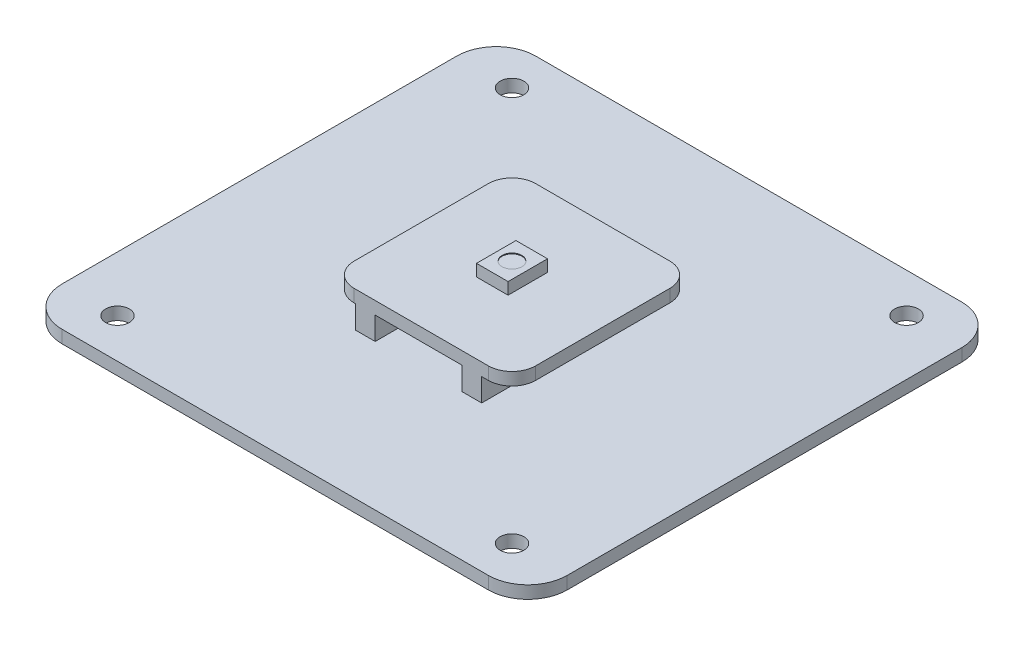
ISO-10303-21;
HEADER;
FILE_DESCRIPTION(('STEP AP214'),'2;1');
FILE_NAME('part.step','',(''),(''),'','','');
FILE_SCHEMA(('AUTOMOTIVE_DESIGN { 1 0 10303 214 1 1 1 1 }'));
ENDSEC;
DATA;
#1=APPLICATION_CONTEXT('core data for automotive mechanical design processes');
#2=APPLICATION_PROTOCOL_DEFINITION('international standard','automotive_design',2000,#1);
#3=PRODUCT_CONTEXT('',#1,'mechanical');
#4=PRODUCT('Part','Part','',(#3));
#5=PRODUCT_RELATED_PRODUCT_CATEGORY('part','',(#4));
#6=PRODUCT_DEFINITION_FORMATION('','',#4);
#7=PRODUCT_DEFINITION_CONTEXT('part definition',#1,'design');
#8=PRODUCT_DEFINITION('design','',#6,#7);
#9=PRODUCT_DEFINITION_SHAPE('','',#8);
#10=(LENGTH_UNIT() NAMED_UNIT(*) SI_UNIT(.MILLI.,.METRE.));
#11=(NAMED_UNIT(*) PLANE_ANGLE_UNIT() SI_UNIT($,.RADIAN.));
#12=(NAMED_UNIT(*) SI_UNIT($,.STERADIAN.) SOLID_ANGLE_UNIT());
#13=UNCERTAINTY_MEASURE_WITH_UNIT(LENGTH_MEASURE(1.E-05),#10,'distance_accuracy_value','');
#14=(GEOMETRIC_REPRESENTATION_CONTEXT(3) GLOBAL_UNCERTAINTY_ASSIGNED_CONTEXT((#13)) GLOBAL_UNIT_ASSIGNED_CONTEXT((#10,
#11,#12)) REPRESENTATION_CONTEXT('',''));
#15=CARTESIAN_POINT('',(0.,0.,0.));
#16=DIRECTION('',(0.,0.,1.));
#17=DIRECTION('',(1.,0.,0.));
#18=AXIS2_PLACEMENT_3D('',#15,#16,#17);
#19=CARTESIAN_POINT('',(-11.5,4.5,-28.));
#20=DIRECTION('',(0.,1.,0.));
#21=DIRECTION('',(0.,0.,1.));
#22=AXIS2_PLACEMENT_3D('',#19,#20,#21);
#23=PLANE('',#22);
#24=DIRECTION('',(-1.,0.,0.));
#25=VECTOR('',#24,1.);
#26=CARTESIAN_POINT('',(-11.5,4.5,-11.5));
#27=LINE('',#26,#25);
#28=CARTESIAN_POINT('',(5.15955688952513,4.5,-11.5));
#29=VERTEX_POINT('',#28);
#30=CARTESIAN_POINT('',(-5.84044311047487,4.5,-11.5));
#31=VERTEX_POINT('',#30);
#32=EDGE_CURVE('E312',#29,#31,#27,.T.);
#33=ORIENTED_EDGE('',*,*,#32,.F.);
#34=DIRECTION('',(0.,0.,1.));
#35=VECTOR('',#34,1.);
#36=CARTESIAN_POINT('',(5.15955688952513,4.5,-15.3288379438153));
#37=LINE('',#36,#35);
#38=CARTESIAN_POINT('',(5.15955688952513,4.5,11.5));
#39=VERTEX_POINT('',#38);
#40=EDGE_CURVE('E240',#29,#39,#37,.T.);
#41=ORIENTED_EDGE('',*,*,#40,.T.);
#42=DIRECTION('',(-1.,0.,0.));
#43=VECTOR('',#42,1.);
#44=CARTESIAN_POINT('',(-11.5,4.5,11.5));
#45=LINE('',#44,#43);
#46=CARTESIAN_POINT('',(-5.84044311047487,4.5,11.5));
#47=VERTEX_POINT('',#46);
#48=EDGE_CURVE('E228',#39,#47,#45,.T.);
#49=ORIENTED_EDGE('',*,*,#48,.T.);
#50=DIRECTION('',(0.,0.,1.));
#51=VECTOR('',#50,1.);
#52=CARTESIAN_POINT('',(-5.84044311047487,4.5,-15.3288379438153));
#53=LINE('',#52,#51);
#54=EDGE_CURVE('E333',#31,#47,#53,.T.);
#55=ORIENTED_EDGE('',*,*,#54,.F.);
#56=EDGE_LOOP('',(#33,#41,#49,#55));
#57=FACE_BOUND('',#56,.T.);
#58=ADVANCED_FACE('F32',(#57),#23,.F.);
#59=CARTESIAN_POINT('',(-27.,0.,25.));
#60=DIRECTION('',(0.,-1.,0.));
#61=DIRECTION('',(0.,0.,-1.));
#62=AXIS2_PLACEMENT_3D('',#59,#60,#61);
#63=PLANE('',#62);
#64=CARTESIAN_POINT('',(-24.9999999999995,0.,25.0000000000004));
#65=DIRECTION('',(0.,1.,0.));
#66=DIRECTION('',(0.,0.,1.));
#67=AXIS2_PLACEMENT_3D('',#64,#65,#66);
#68=CIRCLE('',#67,1.5);
#69=CARTESIAN_POINT('',(-24.9999999999995,0.,26.5000000000004));
#70=VERTEX_POINT('',#69);
#71=EDGE_CURVE('E346',#70,#70,#68,.T.);
#72=ORIENTED_EDGE('',*,*,#71,.T.);
#73=EDGE_LOOP('',(#72));
#74=FACE_BOUND('',#73,.T.);
#75=CARTESIAN_POINT('',(25.,0.,-25.));
#76=DIRECTION('',(0.,1.,0.));
#77=DIRECTION('',(0.,0.,1.));
#78=AXIS2_PLACEMENT_3D('',#75,#76,#77);
#79=CIRCLE('',#78,1.5);
#80=CARTESIAN_POINT('',(25.,0.,-23.5));
#81=VERTEX_POINT('',#80);
#82=EDGE_CURVE('E358',#81,#81,#79,.T.);
#83=ORIENTED_EDGE('',*,*,#82,.T.);
#84=EDGE_LOOP('',(#83));
#85=FACE_BOUND('',#84,.T.);
#86=CARTESIAN_POINT('',(-27.,0.,25.));
#87=DIRECTION('',(0.,1.,0.));
#88=DIRECTION('',(0.,0.,-1.));
#89=AXIS2_PLACEMENT_3D('',#86,#87,#88);
#90=CIRCLE('',#89,5.);
#91=CARTESIAN_POINT('',(-32.,0.,25.));
#92=VERTEX_POINT('',#91);
#93=CARTESIAN_POINT('',(-27.,0.,30.));
#94=VERTEX_POINT('',#93);
#95=EDGE_CURVE('E364',#92,#94,#90,.T.);
#96=ORIENTED_EDGE('',*,*,#95,.F.);
#97=DIRECTION('',(0.,0.,1.));
#98=VECTOR('',#97,1.);
#99=CARTESIAN_POINT('',(-32.,0.,25.));
#100=LINE('',#99,#98);
#101=CARTESIAN_POINT('',(-32.,0.,-25.));
#102=VERTEX_POINT('',#101);
#103=EDGE_CURVE('E371',#102,#92,#100,.T.);
#104=ORIENTED_EDGE('',*,*,#103,.F.);
#105=CARTESIAN_POINT('',(-27.,0.,-25.));
#106=DIRECTION('',(0.,1.,0.));
#107=DIRECTION('',(0.,0.,-1.));
#108=AXIS2_PLACEMENT_3D('',#105,#106,#107);
#109=CIRCLE('',#108,5.);
#110=CARTESIAN_POINT('',(-27.,0.,-30.));
#111=VERTEX_POINT('',#110);
#112=EDGE_CURVE('E398',#111,#102,#109,.T.);
#113=ORIENTED_EDGE('',*,*,#112,.F.);
#114=DIRECTION('',(-1.,0.,0.));
#115=VECTOR('',#114,1.);
#116=CARTESIAN_POINT('',(-27.,0.,-30.));
#117=LINE('',#116,#115);
#118=CARTESIAN_POINT('',(27.,0.,-30.));
#119=VERTEX_POINT('',#118);
#120=EDGE_CURVE('E396',#119,#111,#117,.T.);
#121=ORIENTED_EDGE('',*,*,#120,.F.);
#122=CARTESIAN_POINT('',(27.,0.,-25.));
#123=DIRECTION('',(0.,1.,0.));
#124=DIRECTION('',(0.,0.,-1.));
#125=AXIS2_PLACEMENT_3D('',#122,#123,#124);
#126=CIRCLE('',#125,5.);
#127=CARTESIAN_POINT('',(32.,0.,-25.));
#128=VERTEX_POINT('',#127);
#129=EDGE_CURVE('E394',#128,#119,#126,.T.);
#130=ORIENTED_EDGE('',*,*,#129,.F.);
#131=DIRECTION('',(0.,0.,-1.));
#132=VECTOR('',#131,1.);
#133=CARTESIAN_POINT('',(32.,0.,25.));
#134=LINE('',#133,#132);
#135=CARTESIAN_POINT('',(32.,0.,25.));
#136=VERTEX_POINT('',#135);
#137=EDGE_CURVE('E392',#136,#128,#134,.T.);
#138=ORIENTED_EDGE('',*,*,#137,.F.);
#139=CARTESIAN_POINT('',(27.,0.,25.));
#140=DIRECTION('',(0.,1.,0.));
#141=DIRECTION('',(0.,0.,1.));
#142=AXIS2_PLACEMENT_3D('',#139,#140,#141);
#143=CIRCLE('',#142,5.);
#144=CARTESIAN_POINT('',(27.,0.,30.));
#145=VERTEX_POINT('',#144);
#146=EDGE_CURVE('E390',#145,#136,#143,.T.);
#147=ORIENTED_EDGE('',*,*,#146,.F.);
#148=DIRECTION('',(1.,0.,0.));
#149=VECTOR('',#148,1.);
#150=CARTESIAN_POINT('',(-27.,0.,30.));
#151=LINE('',#150,#149);
#152=EDGE_CURVE('E388',#94,#145,#151,.T.);
#153=ORIENTED_EDGE('',*,*,#152,.F.);
#154=EDGE_LOOP('',(#96,#104,#113,#121,#130,#138,#147,#153));
#155=FACE_BOUND('',#154,.T.);
#156=CARTESIAN_POINT('',(-25.,0.,-24.9999999999996));
#157=DIRECTION('',(0.,1.,0.));
#158=DIRECTION('',(0.,0.,1.));
#159=AXIS2_PLACEMENT_3D('',#156,#157,#158);
#160=CIRCLE('',#159,1.5);
#161=CARTESIAN_POINT('',(-25.,0.,-23.4999999999996));
#162=VERTEX_POINT('',#161);
#163=EDGE_CURVE('E352',#162,#162,#160,.T.);
#164=ORIENTED_EDGE('',*,*,#163,.T.);
#165=EDGE_LOOP('',(#164));
#166=FACE_BOUND('',#165,.T.);
#167=CARTESIAN_POINT('',(25.0000000000005,0.,25.));
#168=DIRECTION('',(0.,1.,0.));
#169=DIRECTION('',(0.,0.,1.));
#170=AXIS2_PLACEMENT_3D('',#167,#168,#169);
#171=CIRCLE('',#170,1.5);
#172=CARTESIAN_POINT('',(25.0000000000005,0.,26.5));
#173=VERTEX_POINT('',#172);
#174=EDGE_CURVE('E342',#173,#173,#171,.T.);
#175=ORIENTED_EDGE('',*,*,#174,.T.);
#176=EDGE_LOOP('',(#175));
#177=FACE_BOUND('',#176,.T.);
#178=ADVANCED_FACE('F510',(#74,#85,#155,#166,#177),#63,.T.);
#179=CARTESIAN_POINT('',(-32.,1.6,25.));
#180=DIRECTION('',(1.,0.,0.));
#181=DIRECTION('',(0.,0.,-1.));
#182=AXIS2_PLACEMENT_3D('',#179,#180,#181);
#183=PLANE('',#182);
#184=ORIENTED_EDGE('',*,*,#103,.T.);
#185=DIRECTION('',(0.,-1.,0.));
#186=VECTOR('',#185,1.);
#187=CARTESIAN_POINT('',(-32.,1.6,25.));
#188=LINE('',#187,#186);
#189=CARTESIAN_POINT('',(-32.,1.6,25.));
#190=VERTEX_POINT('',#189);
#191=EDGE_CURVE('E385',#190,#92,#188,.T.);
#192=ORIENTED_EDGE('',*,*,#191,.F.);
#193=DIRECTION('',(0.,0.,1.));
#194=VECTOR('',#193,1.);
#195=CARTESIAN_POINT('',(-32.,1.6,25.));
#196=LINE('',#195,#194);
#197=CARTESIAN_POINT('',(-32.,1.6,-25.));
#198=VERTEX_POINT('',#197);
#199=EDGE_CURVE('E383',#198,#190,#196,.T.);
#200=ORIENTED_EDGE('',*,*,#199,.F.);
#201=DIRECTION('',(0.,-1.,0.));
#202=VECTOR('',#201,1.);
#203=CARTESIAN_POINT('',(-32.,1.6,-25.));
#204=LINE('',#203,#202);
#205=EDGE_CURVE('E403',#198,#102,#204,.T.);
#206=ORIENTED_EDGE('',*,*,#205,.T.);
#207=EDGE_LOOP('',(#184,#192,#200,#206));
#208=FACE_BOUND('',#207,.T.);
#209=ADVANCED_FACE('F515',(#208),#183,.F.);
#210=CARTESIAN_POINT('',(-27.,1.6,-25.));
#211=DIRECTION('',(0.,-1.,0.));
#212=DIRECTION('',(0.,0.,-1.));
#213=AXIS2_PLACEMENT_3D('',#210,#211,#212);
#214=CYLINDRICAL_SURFACE('',#213,5.);
#215=ORIENTED_EDGE('',*,*,#112,.T.);
#216=ORIENTED_EDGE('',*,*,#205,.F.);
#217=CARTESIAN_POINT('',(-27.,1.6,-25.));
#218=DIRECTION('',(0.,1.,0.));
#219=DIRECTION('',(0.,0.,-1.));
#220=AXIS2_PLACEMENT_3D('',#217,#218,#219);
#221=CIRCLE('',#220,5.);
#222=CARTESIAN_POINT('',(-27.,1.6,-30.));
#223=VERTEX_POINT('',#222);
#224=EDGE_CURVE('E381',#223,#198,#221,.T.);
#225=ORIENTED_EDGE('',*,*,#224,.F.);
#226=DIRECTION('',(0.,-1.,0.));
#227=VECTOR('',#226,1.);
#228=CARTESIAN_POINT('',(-27.,1.6,-30.));
#229=LINE('',#228,#227);
#230=EDGE_CURVE('E406',#223,#111,#229,.T.);
#231=ORIENTED_EDGE('',*,*,#230,.T.);
#232=EDGE_LOOP('',(#215,#216,#225,#231));
#233=FACE_BOUND('',#232,.T.);
#234=ADVANCED_FACE('F595',(#233),#214,.T.);
#235=CARTESIAN_POINT('',(-27.,1.6,-30.));
#236=DIRECTION('',(0.,0.,1.));
#237=DIRECTION('',(1.,0.,0.));
#238=AXIS2_PLACEMENT_3D('',#235,#236,#237);
#239=PLANE('',#238);
#240=ORIENTED_EDGE('',*,*,#120,.T.);
#241=ORIENTED_EDGE('',*,*,#230,.F.);
#242=DIRECTION('',(-1.,0.,0.));
#243=VECTOR('',#242,1.);
#244=CARTESIAN_POINT('',(-27.,1.6,-30.));
#245=LINE('',#244,#243);
#246=CARTESIAN_POINT('',(27.,1.6,-30.));
#247=VERTEX_POINT('',#246);
#248=EDGE_CURVE('E379',#247,#223,#245,.T.);
#249=ORIENTED_EDGE('',*,*,#248,.F.);
#250=DIRECTION('',(0.,-1.,0.));
#251=VECTOR('',#250,1.);
#252=CARTESIAN_POINT('',(27.,1.6,-30.));
#253=LINE('',#252,#251);
#254=EDGE_CURVE('E409',#247,#119,#253,.T.);
#255=ORIENTED_EDGE('',*,*,#254,.T.);
#256=EDGE_LOOP('',(#240,#241,#249,#255));
#257=FACE_BOUND('',#256,.T.);
#258=ADVANCED_FACE('F599',(#257),#239,.F.);
#259=CARTESIAN_POINT('',(27.,1.6,-25.));
#260=DIRECTION('',(0.,-1.,0.));
#261=DIRECTION('',(0.,0.,-1.));
#262=AXIS2_PLACEMENT_3D('',#259,#260,#261);
#263=CYLINDRICAL_SURFACE('',#262,5.);
#264=ORIENTED_EDGE('',*,*,#129,.T.);
#265=ORIENTED_EDGE('',*,*,#254,.F.);
#266=CARTESIAN_POINT('',(27.,1.6,-25.));
#267=DIRECTION('',(0.,1.,0.));
#268=DIRECTION('',(0.,0.,-1.));
#269=AXIS2_PLACEMENT_3D('',#266,#267,#268);
#270=CIRCLE('',#269,5.);
#271=CARTESIAN_POINT('',(32.,1.6,-25.));
#272=VERTEX_POINT('',#271);
#273=EDGE_CURVE('E377',#272,#247,#270,.T.);
#274=ORIENTED_EDGE('',*,*,#273,.F.);
#275=DIRECTION('',(0.,-1.,0.));
#276=VECTOR('',#275,1.);
#277=CARTESIAN_POINT('',(32.,1.6,-25.));
#278=LINE('',#277,#276);
#279=EDGE_CURVE('E412',#272,#128,#278,.T.);
#280=ORIENTED_EDGE('',*,*,#279,.T.);
#281=EDGE_LOOP('',(#264,#265,#274,#280));
#282=FACE_BOUND('',#281,.T.);
#283=ADVANCED_FACE('F603',(#282),#263,.T.);
#284=CARTESIAN_POINT('',(32.,1.6,25.));
#285=DIRECTION('',(-1.,0.,0.));
#286=DIRECTION('',(0.,0.,1.));
#287=AXIS2_PLACEMENT_3D('',#284,#285,#286);
#288=PLANE('',#287);
#289=ORIENTED_EDGE('',*,*,#137,.T.);
#290=ORIENTED_EDGE('',*,*,#279,.F.);
#291=DIRECTION('',(0.,0.,-1.));
#292=VECTOR('',#291,1.);
#293=CARTESIAN_POINT('',(32.,1.6,25.));
#294=LINE('',#293,#292);
#295=CARTESIAN_POINT('',(32.,1.6,25.));
#296=VERTEX_POINT('',#295);
#297=EDGE_CURVE('E375',#296,#272,#294,.T.);
#298=ORIENTED_EDGE('',*,*,#297,.F.);
#299=DIRECTION('',(0.,-1.,0.));
#300=VECTOR('',#299,1.);
#301=CARTESIAN_POINT('',(32.,1.6,25.));
#302=LINE('',#301,#300);
#303=EDGE_CURVE('E415',#296,#136,#302,.T.);
#304=ORIENTED_EDGE('',*,*,#303,.T.);
#305=EDGE_LOOP('',(#289,#290,#298,#304));
#306=FACE_BOUND('',#305,.T.);
#307=ADVANCED_FACE('F607',(#306),#288,.F.);
#308=CARTESIAN_POINT('',(27.,1.6,25.));
#309=DIRECTION('',(0.,-1.,0.));
#310=DIRECTION('',(0.,0.,-1.));
#311=AXIS2_PLACEMENT_3D('',#308,#309,#310);
#312=CYLINDRICAL_SURFACE('',#311,5.);
#313=ORIENTED_EDGE('',*,*,#146,.T.);
#314=ORIENTED_EDGE('',*,*,#303,.F.);
#315=CARTESIAN_POINT('',(27.,1.6,25.));
#316=DIRECTION('',(0.,1.,0.));
#317=DIRECTION('',(0.,0.,1.));
#318=AXIS2_PLACEMENT_3D('',#315,#316,#317);
#319=CIRCLE('',#318,5.);
#320=CARTESIAN_POINT('',(27.,1.6,30.));
#321=VERTEX_POINT('',#320);
#322=EDGE_CURVE('E373',#321,#296,#319,.T.);
#323=ORIENTED_EDGE('',*,*,#322,.F.);
#324=DIRECTION('',(0.,-1.,0.));
#325=VECTOR('',#324,1.);
#326=CARTESIAN_POINT('',(27.,1.6,30.));
#327=LINE('',#326,#325);
#328=EDGE_CURVE('E418',#321,#145,#327,.T.);
#329=ORIENTED_EDGE('',*,*,#328,.T.);
#330=EDGE_LOOP('',(#313,#314,#323,#329));
#331=FACE_BOUND('',#330,.T.);
#332=ADVANCED_FACE('F611',(#331),#312,.T.);
#333=CARTESIAN_POINT('',(-27.,1.6,30.));
#334=DIRECTION('',(0.,0.,-1.));
#335=DIRECTION('',(-1.,0.,0.));
#336=AXIS2_PLACEMENT_3D('',#333,#334,#335);
#337=PLANE('',#336);
#338=ORIENTED_EDGE('',*,*,#152,.T.);
#339=ORIENTED_EDGE('',*,*,#328,.F.);
#340=DIRECTION('',(1.,0.,0.));
#341=VECTOR('',#340,1.);
#342=CARTESIAN_POINT('',(-27.,1.6,30.));
#343=LINE('',#342,#341);
#344=CARTESIAN_POINT('',(-27.,1.6,30.));
#345=VERTEX_POINT('',#344);
#346=EDGE_CURVE('E370',#345,#321,#343,.T.);
#347=ORIENTED_EDGE('',*,*,#346,.F.);
#348=DIRECTION('',(0.,-1.,0.));
#349=VECTOR('',#348,1.);
#350=CARTESIAN_POINT('',(-27.,1.6,30.));
#351=LINE('',#350,#349);
#352=EDGE_CURVE('E421',#345,#94,#351,.T.);
#353=ORIENTED_EDGE('',*,*,#352,.T.);
#354=EDGE_LOOP('',(#338,#339,#347,#353));
#355=FACE_BOUND('',#354,.T.);
#356=ADVANCED_FACE('F615',(#355),#337,.F.);
#357=CARTESIAN_POINT('',(-27.,1.6,25.));
#358=DIRECTION('',(0.,-1.,0.));
#359=DIRECTION('',(0.,0.,-1.));
#360=AXIS2_PLACEMENT_3D('',#357,#358,#359);
#361=CYLINDRICAL_SURFACE('',#360,5.);
#362=ORIENTED_EDGE('',*,*,#95,.T.);
#363=ORIENTED_EDGE('',*,*,#352,.F.);
#364=CARTESIAN_POINT('',(-27.,1.6,25.));
#365=DIRECTION('',(0.,1.,0.));
#366=DIRECTION('',(0.,0.,-1.));
#367=AXIS2_PLACEMENT_3D('',#364,#365,#366);
#368=CIRCLE('',#367,5.);
#369=EDGE_CURVE('E367',#190,#345,#368,.T.);
#370=ORIENTED_EDGE('',*,*,#369,.F.);
#371=ORIENTED_EDGE('',*,*,#191,.T.);
#372=EDGE_LOOP('',(#362,#363,#370,#371));
#373=FACE_BOUND('',#372,.T.);
#374=ADVANCED_FACE('F619',(#373),#361,.T.);
#375=CARTESIAN_POINT('',(25.,1.6,-25.));
#376=DIRECTION('',(0.,-1.,0.));
#377=DIRECTION('',(0.,0.,-1.));
#378=AXIS2_PLACEMENT_3D('',#375,#376,#377);
#379=CYLINDRICAL_SURFACE('',#378,1.5);
#380=CARTESIAN_POINT('',(25.,1.6,-25.));
#381=DIRECTION('',(0.,1.,0.));
#382=DIRECTION('',(0.,0.,1.));
#383=AXIS2_PLACEMENT_3D('',#380,#381,#382);
#384=CIRCLE('',#383,1.5);
#385=CARTESIAN_POINT('',(25.,1.6,-23.5));
#386=VERTEX_POINT('',#385);
#387=EDGE_CURVE('E361',#386,#386,#384,.T.);
#388=ORIENTED_EDGE('',*,*,#387,.T.);
#389=EDGE_LOOP('',(#388));
#390=FACE_BOUND('',#389,.T.);
#391=ORIENTED_EDGE('',*,*,#82,.F.);
#392=EDGE_LOOP('',(#391));
#393=FACE_BOUND('',#392,.T.);
#394=ADVANCED_FACE('F590',(#390,#393),#379,.F.);
#395=CARTESIAN_POINT('',(-25.,1.6,-24.9999999999996));
#396=DIRECTION('',(0.,-1.,0.));
#397=DIRECTION('',(0.,0.,-1.));
#398=AXIS2_PLACEMENT_3D('',#395,#396,#397);
#399=CYLINDRICAL_SURFACE('',#398,1.5);
#400=CARTESIAN_POINT('',(-25.,1.6,-24.9999999999996));
#401=DIRECTION('',(0.,1.,0.));
#402=DIRECTION('',(0.,0.,1.));
#403=AXIS2_PLACEMENT_3D('',#400,#401,#402);
#404=CIRCLE('',#403,1.5);
#405=CARTESIAN_POINT('',(-25.,1.6,-23.4999999999996));
#406=VERTEX_POINT('',#405);
#407=EDGE_CURVE('E355',#406,#406,#404,.T.);
#408=ORIENTED_EDGE('',*,*,#407,.T.);
#409=EDGE_LOOP('',(#408));
#410=FACE_BOUND('',#409,.T.);
#411=ORIENTED_EDGE('',*,*,#163,.F.);
#412=EDGE_LOOP('',(#411));
#413=FACE_BOUND('',#412,.T.);
#414=ADVANCED_FACE('F785',(#410,#413),#399,.F.);
#415=CARTESIAN_POINT('',(-24.9999999999995,1.6,25.0000000000004));
#416=DIRECTION('',(0.,-1.,0.));
#417=DIRECTION('',(0.,0.,-1.));
#418=AXIS2_PLACEMENT_3D('',#415,#416,#417);
#419=CYLINDRICAL_SURFACE('',#418,1.5);
#420=CARTESIAN_POINT('',(-24.9999999999995,1.6,25.0000000000004));
#421=DIRECTION('',(0.,1.,0.));
#422=DIRECTION('',(0.,0.,1.));
#423=AXIS2_PLACEMENT_3D('',#420,#421,#422);
#424=CIRCLE('',#423,1.5);
#425=CARTESIAN_POINT('',(-24.9999999999995,1.6,26.5000000000004));
#426=VERTEX_POINT('',#425);
#427=EDGE_CURVE('E349',#426,#426,#424,.T.);
#428=ORIENTED_EDGE('',*,*,#427,.T.);
#429=EDGE_LOOP('',(#428));
#430=FACE_BOUND('',#429,.T.);
#431=ORIENTED_EDGE('',*,*,#71,.F.);
#432=EDGE_LOOP('',(#431));
#433=FACE_BOUND('',#432,.T.);
#434=ADVANCED_FACE('F586',(#430,#433),#419,.F.);
#435=CARTESIAN_POINT('',(25.0000000000005,1.6,25.));
#436=DIRECTION('',(0.,-1.,0.));
#437=DIRECTION('',(0.,0.,-1.));
#438=AXIS2_PLACEMENT_3D('',#435,#436,#437);
#439=CYLINDRICAL_SURFACE('',#438,1.5);
#440=CARTESIAN_POINT('',(25.0000000000005,1.6,25.));
#441=DIRECTION('',(0.,1.,0.));
#442=DIRECTION('',(0.,0.,1.));
#443=AXIS2_PLACEMENT_3D('',#440,#441,#442);
#444=CIRCLE('',#443,1.5);
#445=CARTESIAN_POINT('',(25.0000000000005,1.6,26.5));
#446=VERTEX_POINT('',#445);
#447=EDGE_CURVE('E343',#446,#446,#444,.T.);
#448=ORIENTED_EDGE('',*,*,#447,.T.);
#449=EDGE_LOOP('',(#448));
#450=FACE_BOUND('',#449,.T.);
#451=ORIENTED_EDGE('',*,*,#174,.F.);
#452=EDGE_LOOP('',(#451));
#453=FACE_BOUND('',#452,.T.);
#454=ADVANCED_FACE('F579',(#450,#453),#439,.F.);
#455=CARTESIAN_POINT('',(-27.,1.6,25.));
#456=DIRECTION('',(0.,-1.,0.));
#457=DIRECTION('',(0.,0.,-1.));
#458=AXIS2_PLACEMENT_3D('',#455,#456,#457);
#459=PLANE('',#458);
#460=DIRECTION('',(0.,0.,1.));
#461=VECTOR('',#460,1.);
#462=CARTESIAN_POINT('',(7.65955688952514,1.6,-15.3288379438153));
#463=LINE('',#462,#461);
#464=CARTESIAN_POINT('',(7.65955688952513,1.6,-11.5));
#465=VERTEX_POINT('',#464);
#466=CARTESIAN_POINT('',(7.65955688952513,1.6,11.5));
#467=VERTEX_POINT('',#466);
#468=EDGE_CURVE('E241',#465,#467,#463,.T.);
#469=ORIENTED_EDGE('',*,*,#468,.T.);
#470=DIRECTION('',(1.,0.,0.));
#471=VECTOR('',#470,1.);
#472=CARTESIAN_POINT('',(5.15955688952513,1.6,11.5));
#473=LINE('',#472,#471);
#474=CARTESIAN_POINT('',(5.15955688952513,1.6,11.5));
#475=VERTEX_POINT('',#474);
#476=EDGE_CURVE('E246',#475,#467,#473,.T.);
#477=ORIENTED_EDGE('',*,*,#476,.F.);
#478=DIRECTION('',(0.,0.,1.));
#479=VECTOR('',#478,1.);
#480=CARTESIAN_POINT('',(5.15955688952513,1.6,-15.3288379438153));
#481=LINE('',#480,#479);
#482=CARTESIAN_POINT('',(5.15955688952513,1.6,-11.5));
#483=VERTEX_POINT('',#482);
#484=EDGE_CURVE('E247',#483,#475,#481,.T.);
#485=ORIENTED_EDGE('',*,*,#484,.F.);
#486=DIRECTION('',(-1.,0.,0.));
#487=VECTOR('',#486,1.);
#488=CARTESIAN_POINT('',(5.15955688952513,1.6,-11.5));
#489=LINE('',#488,#487);
#490=EDGE_CURVE('E258',#465,#483,#489,.T.);
#491=ORIENTED_EDGE('',*,*,#490,.F.);
#492=EDGE_LOOP('',(#469,#477,#485,#491));
#493=FACE_BOUND('',#492,.T.);
#494=DIRECTION('',(0.,0.,1.));
#495=VECTOR('',#494,1.);
#496=CARTESIAN_POINT('',(-5.84044311047487,1.6,-15.3288379438153));
#497=LINE('',#496,#495);
#498=CARTESIAN_POINT('',(-5.84044311047487,1.6,-11.5));
#499=VERTEX_POINT('',#498);
#500=CARTESIAN_POINT('',(-5.84044311047487,1.6,11.5));
#501=VERTEX_POINT('',#500);
#502=EDGE_CURVE('E336',#499,#501,#497,.T.);
#503=ORIENTED_EDGE('',*,*,#502,.T.);
#504=DIRECTION('',(1.,0.,0.));
#505=VECTOR('',#504,1.);
#506=CARTESIAN_POINT('',(-8.34044311047487,1.6,11.5));
#507=LINE('',#506,#505);
#508=CARTESIAN_POINT('',(-8.34044311047487,1.6,11.5));
#509=VERTEX_POINT('',#508);
#510=EDGE_CURVE('E325',#509,#501,#507,.T.);
#511=ORIENTED_EDGE('',*,*,#510,.F.);
#512=DIRECTION('',(0.,0.,1.));
#513=VECTOR('',#512,1.);
#514=CARTESIAN_POINT('',(-8.34044311047487,1.6,-15.3288379438153));
#515=LINE('',#514,#513);
#516=CARTESIAN_POINT('',(-8.34044311047487,1.6,-11.5));
#517=VERTEX_POINT('',#516);
#518=EDGE_CURVE('E331',#517,#509,#515,.T.);
#519=ORIENTED_EDGE('',*,*,#518,.F.);
#520=DIRECTION('',(-1.,0.,0.));
#521=VECTOR('',#520,1.);
#522=CARTESIAN_POINT('',(-8.34044311047487,1.6,-11.5));
#523=LINE('',#522,#521);
#524=EDGE_CURVE('E322',#499,#517,#523,.T.);
#525=ORIENTED_EDGE('',*,*,#524,.F.);
#526=EDGE_LOOP('',(#503,#511,#519,#525));
#527=FACE_BOUND('',#526,.T.);
#528=ORIENTED_EDGE('',*,*,#447,.F.);
#529=EDGE_LOOP('',(#528));
#530=FACE_BOUND('',#529,.T.);
#531=ORIENTED_EDGE('',*,*,#427,.F.);
#532=EDGE_LOOP('',(#531));
#533=FACE_BOUND('',#532,.T.);
#534=ORIENTED_EDGE('',*,*,#407,.F.);
#535=EDGE_LOOP('',(#534));
#536=FACE_BOUND('',#535,.T.);
#537=ORIENTED_EDGE('',*,*,#387,.F.);
#538=EDGE_LOOP('',(#537));
#539=FACE_BOUND('',#538,.T.);
#540=ORIENTED_EDGE('',*,*,#369,.T.);
#541=ORIENTED_EDGE('',*,*,#346,.T.);
#542=ORIENTED_EDGE('',*,*,#322,.T.);
#543=ORIENTED_EDGE('',*,*,#297,.T.);
#544=ORIENTED_EDGE('',*,*,#273,.T.);
#545=ORIENTED_EDGE('',*,*,#248,.T.);
#546=ORIENTED_EDGE('',*,*,#224,.T.);
#547=ORIENTED_EDGE('',*,*,#199,.T.);
#548=EDGE_LOOP('',(#540,#541,#542,#543,#544,#545,#546,#547));
#549=FACE_BOUND('',#548,.T.);
#550=ADVANCED_FACE('F495',(#493,#527,#530,#533,#536,#539,#549),#459,.F.);
#551=CARTESIAN_POINT('',(-8.34044311047487,4.5,-15.3288379438153));
#552=DIRECTION('',(-1.,0.,0.));
#553=DIRECTION('',(0.,0.,1.));
#554=AXIS2_PLACEMENT_3D('',#551,#552,#553);
#555=PLANE('',#554);
#556=DIRECTION('',(0.,1.,0.));
#557=VECTOR('',#556,1.);
#558=CARTESIAN_POINT('',(-8.34044311047487,4.5,-11.5));
#559=LINE('',#558,#557);
#560=CARTESIAN_POINT('',(-8.34044311047487,4.5,-11.5));
#561=VERTEX_POINT('',#560);
#562=EDGE_CURVE('E318',#517,#561,#559,.T.);
#563=ORIENTED_EDGE('',*,*,#562,.F.);
#564=ORIENTED_EDGE('',*,*,#518,.T.);
#565=DIRECTION('',(0.,-1.,0.));
#566=VECTOR('',#565,1.);
#567=CARTESIAN_POINT('',(-8.34044311047487,4.5,11.5));
#568=LINE('',#567,#566);
#569=CARTESIAN_POINT('',(-8.34044311047487,4.5,11.5));
#570=VERTEX_POINT('',#569);
#571=EDGE_CURVE('E227',#570,#509,#568,.T.);
#572=ORIENTED_EDGE('',*,*,#571,.F.);
#573=DIRECTION('',(0.,0.,1.));
#574=VECTOR('',#573,1.);
#575=CARTESIAN_POINT('',(-8.34044311047487,4.5,-15.3288379438153));
#576=LINE('',#575,#574);
#577=EDGE_CURVE('E319',#561,#570,#576,.T.);
#578=ORIENTED_EDGE('',*,*,#577,.F.);
#579=EDGE_LOOP('',(#563,#564,#572,#578));
#580=FACE_BOUND('',#579,.T.);
#581=ADVANCED_FACE('F498',(#580),#555,.T.);
#582=CARTESIAN_POINT('',(-5.84044311047487,4.5,-15.3288379438153));
#583=DIRECTION('',(1.,0.,0.));
#584=DIRECTION('',(0.,1.,0.));
#585=AXIS2_PLACEMENT_3D('',#582,#583,#584);
#586=PLANE('',#585);
#587=DIRECTION('',(0.,-1.,0.));
#588=VECTOR('',#587,1.);
#589=CARTESIAN_POINT('',(-5.84044311047487,4.5,-11.5));
#590=LINE('',#589,#588);
#591=EDGE_CURVE('E315',#31,#499,#590,.T.);
#592=ORIENTED_EDGE('',*,*,#591,.F.);
#593=ORIENTED_EDGE('',*,*,#54,.T.);
#594=DIRECTION('',(0.,1.,0.));
#595=VECTOR('',#594,1.);
#596=CARTESIAN_POINT('',(-5.84044311047487,4.5,11.5));
#597=LINE('',#596,#595);
#598=EDGE_CURVE('E328',#501,#47,#597,.T.);
#599=ORIENTED_EDGE('',*,*,#598,.F.);
#600=ORIENTED_EDGE('',*,*,#502,.F.);
#601=EDGE_LOOP('',(#592,#593,#599,#600));
#602=FACE_BOUND('',#601,.T.);
#603=ADVANCED_FACE('F493',(#602),#586,.T.);
#604=CARTESIAN_POINT('',(0.,0.,11.5));
#605=DIRECTION('',(0.,0.,1.));
#606=DIRECTION('',(1.,0.,0.));
#607=AXIS2_PLACEMENT_3D('',#604,#605,#606);
#608=PLANE('',#607);
#609=DIRECTION('',(1.,0.,0.));
#610=VECTOR('',#609,1.);
#611=CARTESIAN_POINT('',(-11.5,6.1,11.5));
#612=LINE('',#611,#610);
#613=CARTESIAN_POINT('',(-8.5,6.1,11.5));
#614=VERTEX_POINT('',#613);
#615=CARTESIAN_POINT('',(8.49999999999999,6.1,11.5));
#616=VERTEX_POINT('',#615);
#617=EDGE_CURVE('E263',#614,#616,#612,.T.);
#618=ORIENTED_EDGE('',*,*,#617,.F.);
#619=DIRECTION('',(0.,-1.,0.));
#620=VECTOR('',#619,1.);
#621=CARTESIAN_POINT('',(-8.5,4.5,11.5));
#622=LINE('',#621,#620);
#623=CARTESIAN_POINT('',(-8.5,4.5,11.5));
#624=VERTEX_POINT('',#623);
#625=EDGE_CURVE('E11',#614,#624,#622,.T.);
#626=ORIENTED_EDGE('',*,*,#625,.T.);
#627=EDGE_CURVE('E230',#570,#624,#45,.T.);
#628=ORIENTED_EDGE('',*,*,#627,.F.);
#629=ORIENTED_EDGE('',*,*,#571,.T.);
#630=ORIENTED_EDGE('',*,*,#510,.T.);
#631=ORIENTED_EDGE('',*,*,#598,.T.);
#632=ORIENTED_EDGE('',*,*,#48,.F.);
#633=DIRECTION('',(0.,-1.,0.));
#634=VECTOR('',#633,1.);
#635=CARTESIAN_POINT('',(5.15955688952513,4.5,11.5));
#636=LINE('',#635,#634);
#637=EDGE_CURVE('E251',#39,#475,#636,.T.);
#638=ORIENTED_EDGE('',*,*,#637,.T.);
#639=ORIENTED_EDGE('',*,*,#476,.T.);
#640=DIRECTION('',(0.,1.,0.));
#641=VECTOR('',#640,1.);
#642=CARTESIAN_POINT('',(7.65955688952513,4.5,11.5));
#643=LINE('',#642,#641);
#644=CARTESIAN_POINT('',(7.65955688952513,4.5,11.5));
#645=VERTEX_POINT('',#644);
#646=EDGE_CURVE('E236',#467,#645,#643,.T.);
#647=ORIENTED_EDGE('',*,*,#646,.T.);
#648=CARTESIAN_POINT('',(8.49999999999999,4.5,11.5));
#649=VERTEX_POINT('',#648);
#650=EDGE_CURVE('E217',#649,#645,#45,.T.);
#651=ORIENTED_EDGE('',*,*,#650,.F.);
#652=DIRECTION('',(0.,-1.,0.));
#653=VECTOR('',#652,1.);
#654=CARTESIAN_POINT('',(8.5,6.1,11.5));
#655=LINE('',#654,#653);
#656=EDGE_CURVE('E40',#649,#616,#655,.F.);
#657=ORIENTED_EDGE('',*,*,#656,.T.);
#658=EDGE_LOOP('',(#618,#626,#628,#629,#630,#631,#632,#638,#639,#647,#651,#657));
#659=FACE_BOUND('',#658,.T.);
#660=ADVANCED_FACE('F244',(#659),#608,.T.);
#661=CARTESIAN_POINT('',(-11.5,6.1,-11.5));
#662=DIRECTION('',(0.,0.,1.));
#663=DIRECTION('',(1.,0.,0.));
#664=AXIS2_PLACEMENT_3D('',#661,#662,#663);
#665=PLANE('',#664);
#666=DIRECTION('',(-1.,0.,0.));
#667=VECTOR('',#666,1.);
#668=CARTESIAN_POINT('',(-11.5,6.1,-11.5));
#669=LINE('',#668,#667);
#670=CARTESIAN_POINT('',(8.49999999999999,6.1,-11.5));
#671=VERTEX_POINT('',#670);
#672=CARTESIAN_POINT('',(-8.5,6.1,-11.5));
#673=VERTEX_POINT('',#672);
#674=EDGE_CURVE('E270',#671,#673,#669,.T.);
#675=ORIENTED_EDGE('',*,*,#674,.F.);
#676=DIRECTION('',(0.,-1.,0.));
#677=VECTOR('',#676,1.);
#678=CARTESIAN_POINT('',(8.49999999999999,6.1,-11.5));
#679=LINE('',#678,#677);
#680=CARTESIAN_POINT('',(8.49999999999999,4.5,-11.5));
#681=VERTEX_POINT('',#680);
#682=EDGE_CURVE('E426',#671,#681,#679,.T.);
#683=ORIENTED_EDGE('',*,*,#682,.T.);
#684=CARTESIAN_POINT('',(7.65955688952513,4.5,-11.5));
#685=VERTEX_POINT('',#684);
#686=EDGE_CURVE('E310',#681,#685,#27,.T.);
#687=ORIENTED_EDGE('',*,*,#686,.T.);
#688=DIRECTION('',(0.,-1.,0.));
#689=VECTOR('',#688,1.);
#690=CARTESIAN_POINT('',(7.65955688952513,4.5,-11.5));
#691=LINE('',#690,#689);
#692=EDGE_CURVE('E239',#685,#465,#691,.T.);
#693=ORIENTED_EDGE('',*,*,#692,.T.);
#694=ORIENTED_EDGE('',*,*,#490,.T.);
#695=DIRECTION('',(0.,1.,0.));
#696=VECTOR('',#695,1.);
#697=CARTESIAN_POINT('',(5.15955688952513,4.5,-11.5));
#698=LINE('',#697,#696);
#699=EDGE_CURVE('E262',#483,#29,#698,.T.);
#700=ORIENTED_EDGE('',*,*,#699,.T.);
#701=ORIENTED_EDGE('',*,*,#32,.T.);
#702=ORIENTED_EDGE('',*,*,#591,.T.);
#703=ORIENTED_EDGE('',*,*,#524,.T.);
#704=ORIENTED_EDGE('',*,*,#562,.T.);
#705=CARTESIAN_POINT('',(-8.5,4.5,-11.5));
#706=VERTEX_POINT('',#705);
#707=EDGE_CURVE('E266',#561,#706,#27,.T.);
#708=ORIENTED_EDGE('',*,*,#707,.T.);
#709=DIRECTION('',(0.,-1.,0.));
#710=VECTOR('',#709,1.);
#711=CARTESIAN_POINT('',(-8.5,6.1,-11.5));
#712=LINE('',#711,#710);
#713=EDGE_CURVE('E424',#706,#673,#712,.F.);
#714=ORIENTED_EDGE('',*,*,#713,.T.);
#715=EDGE_LOOP('',(#675,#683,#687,#693,#694,#700,#701,#702,#703,#704,#708,#714));
#716=FACE_BOUND('',#715,.T.);
#717=ADVANCED_FACE('F470',(#716),#665,.F.);
#718=DIRECTION('',(0.,0.,1.));
#719=VECTOR('',#718,1.);
#720=CARTESIAN_POINT('',(-11.5,4.5,-28.));
#721=LINE('',#720,#719);
#722=CARTESIAN_POINT('',(-11.5,4.5,-8.5));
#723=VERTEX_POINT('',#722);
#724=CARTESIAN_POINT('',(-11.5,4.5,8.5));
#725=VERTEX_POINT('',#724);
#726=EDGE_CURVE('E300',#723,#725,#721,.T.);
#727=ORIENTED_EDGE('',*,*,#726,.F.);
#728=CARTESIAN_POINT('',(-8.5,4.5,-8.5));
#729=DIRECTION('',(0.,1.,0.));
#730=DIRECTION('',(0.,0.,1.));
#731=AXIS2_PLACEMENT_3D('',#728,#729,#730);
#732=CIRCLE('',#731,3.);
#733=EDGE_CURVE('E451',#723,#706,#732,.F.);
#734=ORIENTED_EDGE('',*,*,#733,.T.);
#735=ORIENTED_EDGE('',*,*,#707,.F.);
#736=ORIENTED_EDGE('',*,*,#577,.T.);
#737=ORIENTED_EDGE('',*,*,#627,.T.);
#738=CARTESIAN_POINT('',(-8.5,4.5,8.5));
#739=DIRECTION('',(0.,1.,0.));
#740=DIRECTION('',(0.,0.,1.));
#741=AXIS2_PLACEMENT_3D('',#738,#739,#740);
#742=CIRCLE('',#741,3.);
#743=EDGE_CURVE('E47',#624,#725,#742,.F.);
#744=ORIENTED_EDGE('',*,*,#743,.T.);
#745=EDGE_LOOP('',(#727,#734,#735,#736,#737,#744));
#746=FACE_BOUND('',#745,.T.);
#747=ADVANCED_FACE('F480',(#746),#23,.F.);
#748=CARTESIAN_POINT('',(0.,6.1,0.));
#749=DIRECTION('',(0.,-1.,0.));
#750=DIRECTION('',(0.,0.,-1.));
#751=AXIS2_PLACEMENT_3D('',#748,#749,#750);
#752=PLANE('',#751);
#753=DIRECTION('',(0.,0.,-1.));
#754=VECTOR('',#753,1.);
#755=CARTESIAN_POINT('',(11.5,6.1,11.5));
#756=LINE('',#755,#754);
#757=CARTESIAN_POINT('',(11.5,6.1,8.5));
#758=VERTEX_POINT('',#757);
#759=CARTESIAN_POINT('',(11.5,6.1,-8.5));
#760=VERTEX_POINT('',#759);
#761=EDGE_CURVE('E261',#758,#760,#756,.T.);
#762=ORIENTED_EDGE('',*,*,#761,.T.);
#763=CARTESIAN_POINT('',(8.49999999999999,6.1,-8.5));
#764=DIRECTION('',(0.,-1.,0.));
#765=DIRECTION('',(0.,0.,-1.));
#766=AXIS2_PLACEMENT_3D('',#763,#764,#765);
#767=CIRCLE('',#766,3.);
#768=EDGE_CURVE('E443',#760,#671,#767,.F.);
#769=ORIENTED_EDGE('',*,*,#768,.T.);
#770=ORIENTED_EDGE('',*,*,#674,.T.);
#771=CARTESIAN_POINT('',(-8.5,6.1,-8.5));
#772=DIRECTION('',(0.,-1.,0.));
#773=DIRECTION('',(0.,0.,-1.));
#774=AXIS2_PLACEMENT_3D('',#771,#772,#773);
#775=CIRCLE('',#774,3.);
#776=CARTESIAN_POINT('',(-11.5,6.1,-8.5));
#777=VERTEX_POINT('',#776);
#778=EDGE_CURVE('E441',#673,#777,#775,.F.);
#779=ORIENTED_EDGE('',*,*,#778,.T.);
#780=DIRECTION('',(0.,0.,1.));
#781=VECTOR('',#780,1.);
#782=CARTESIAN_POINT('',(-11.5,6.1,11.5));
#783=LINE('',#782,#781);
#784=CARTESIAN_POINT('',(-11.5,6.1,8.5));
#785=VERTEX_POINT('',#784);
#786=EDGE_CURVE('E267',#777,#785,#783,.T.);
#787=ORIENTED_EDGE('',*,*,#786,.T.);
#788=CARTESIAN_POINT('',(-8.5,6.1,8.5));
#789=DIRECTION('',(0.,-1.,0.));
#790=DIRECTION('',(0.,0.,-1.));
#791=AXIS2_PLACEMENT_3D('',#788,#789,#790);
#792=CIRCLE('',#791,3.);
#793=EDGE_CURVE('E439',#785,#614,#792,.F.);
#794=ORIENTED_EDGE('',*,*,#793,.T.);
#795=ORIENTED_EDGE('',*,*,#617,.T.);
#796=CARTESIAN_POINT('',(8.5,6.1,8.5));
#797=DIRECTION('',(0.,-1.,0.));
#798=DIRECTION('',(0.,0.,-1.));
#799=AXIS2_PLACEMENT_3D('',#796,#797,#798);
#800=CIRCLE('',#799,3.);
#801=EDGE_CURVE('E437',#616,#758,#800,.F.);
#802=ORIENTED_EDGE('',*,*,#801,.T.);
#803=EDGE_LOOP('',(#762,#769,#770,#779,#787,#794,#795,#802));
#804=FACE_BOUND('',#803,.T.);
#805=DIRECTION('',(0.,0.,-1.));
#806=VECTOR('',#805,1.);
#807=CARTESIAN_POINT('',(2.,6.1,2.5));
#808=LINE('',#807,#806);
#809=CARTESIAN_POINT('',(2.,6.1,2.5));
#810=VERTEX_POINT('',#809);
#811=CARTESIAN_POINT('',(2.,6.1,-2.5));
#812=VERTEX_POINT('',#811);
#813=EDGE_CURVE('E291',#810,#812,#808,.T.);
#814=ORIENTED_EDGE('',*,*,#813,.F.);
#815=DIRECTION('',(1.,0.,0.));
#816=VECTOR('',#815,1.);
#817=CARTESIAN_POINT('',(-2.,6.1,2.5));
#818=LINE('',#817,#816);
#819=CARTESIAN_POINT('',(-2.,6.1,2.5));
#820=VERTEX_POINT('',#819);
#821=EDGE_CURVE('E283',#820,#810,#818,.T.);
#822=ORIENTED_EDGE('',*,*,#821,.F.);
#823=DIRECTION('',(0.,0.,1.));
#824=VECTOR('',#823,1.);
#825=CARTESIAN_POINT('',(-2.,6.1,2.5));
#826=LINE('',#825,#824);
#827=CARTESIAN_POINT('',(-2.,6.1,-2.5));
#828=VERTEX_POINT('',#827);
#829=EDGE_CURVE('E278',#828,#820,#826,.T.);
#830=ORIENTED_EDGE('',*,*,#829,.F.);
#831=DIRECTION('',(-1.,0.,0.));
#832=VECTOR('',#831,1.);
#833=CARTESIAN_POINT('',(-2.,6.1,-2.5));
#834=LINE('',#833,#832);
#835=EDGE_CURVE('E279',#812,#828,#834,.T.);
#836=ORIENTED_EDGE('',*,*,#835,.F.);
#837=EDGE_LOOP('',(#814,#822,#830,#836));
#838=FACE_BOUND('',#837,.T.);
#839=ADVANCED_FACE('F455',(#804,#838),#752,.F.);
#840=CARTESIAN_POINT('',(11.5,6.1,11.5));
#841=DIRECTION('',(-1.,0.,0.));
#842=DIRECTION('',(0.,0.,1.));
#843=AXIS2_PLACEMENT_3D('',#840,#841,#842);
#844=PLANE('',#843);
#845=DIRECTION('',(0.,0.,1.));
#846=VECTOR('',#845,1.);
#847=CARTESIAN_POINT('',(11.5,4.5,-28.));
#848=LINE('',#847,#846);
#849=CARTESIAN_POINT('',(11.5,4.5,-8.5));
#850=VERTEX_POINT('',#849);
#851=CARTESIAN_POINT('',(11.5,4.5,8.5));
#852=VERTEX_POINT('',#851);
#853=EDGE_CURVE('E303',#850,#852,#848,.T.);
#854=ORIENTED_EDGE('',*,*,#853,.F.);
#855=DIRECTION('',(0.,-1.,0.));
#856=VECTOR('',#855,1.);
#857=CARTESIAN_POINT('',(11.5,6.1,-8.5));
#858=LINE('',#857,#856);
#859=EDGE_CURVE('E435',#850,#760,#858,.F.);
#860=ORIENTED_EDGE('',*,*,#859,.T.);
#861=ORIENTED_EDGE('',*,*,#761,.F.);
#862=DIRECTION('',(0.,-1.,0.));
#863=VECTOR('',#862,1.);
#864=CARTESIAN_POINT('',(11.5,4.5,8.5));
#865=LINE('',#864,#863);
#866=EDGE_CURVE('E432',#758,#852,#865,.T.);
#867=ORIENTED_EDGE('',*,*,#866,.T.);
#868=EDGE_LOOP('',(#854,#860,#861,#867));
#869=FACE_BOUND('',#868,.T.);
#870=ADVANCED_FACE('F462',(#869),#844,.F.);
#871=CARTESIAN_POINT('',(-11.5,6.1,11.5));
#872=DIRECTION('',(1.,0.,0.));
#873=DIRECTION('',(0.,0.,-1.));
#874=AXIS2_PLACEMENT_3D('',#871,#872,#873);
#875=PLANE('',#874);
#876=ORIENTED_EDGE('',*,*,#786,.F.);
#877=DIRECTION('',(0.,-1.,0.));
#878=VECTOR('',#877,1.);
#879=CARTESIAN_POINT('',(-11.5,6.1,-8.5));
#880=LINE('',#879,#878);
#881=EDGE_CURVE('E447',#777,#723,#880,.T.);
#882=ORIENTED_EDGE('',*,*,#881,.T.);
#883=ORIENTED_EDGE('',*,*,#726,.T.);
#884=DIRECTION('',(0.,-1.,0.));
#885=VECTOR('',#884,1.);
#886=CARTESIAN_POINT('',(-11.5,6.1,8.5));
#887=LINE('',#886,#885);
#888=EDGE_CURVE('E445',#725,#785,#887,.F.);
#889=ORIENTED_EDGE('',*,*,#888,.T.);
#890=EDGE_LOOP('',(#876,#882,#883,#889));
#891=FACE_BOUND('',#890,.T.);
#892=ADVANCED_FACE('F479',(#891),#875,.F.);
#893=CARTESIAN_POINT('',(2.,7.6,2.5));
#894=DIRECTION('',(-1.,0.,0.));
#895=DIRECTION('',(0.,0.,1.));
#896=AXIS2_PLACEMENT_3D('',#893,#894,#895);
#897=PLANE('',#896);
#898=ORIENTED_EDGE('',*,*,#813,.T.);
#899=DIRECTION('',(0.,-1.,0.));
#900=VECTOR('',#899,1.);
#901=CARTESIAN_POINT('',(2.,7.6,-2.5));
#902=LINE('',#901,#900);
#903=CARTESIAN_POINT('',(2.,7.6,-2.5));
#904=VERTEX_POINT('',#903);
#905=EDGE_CURVE('E275',#904,#812,#902,.T.);
#906=ORIENTED_EDGE('',*,*,#905,.F.);
#907=DIRECTION('',(0.,0.,-1.));
#908=VECTOR('',#907,1.);
#909=CARTESIAN_POINT('',(2.,7.6,2.5));
#910=LINE('',#909,#908);
#911=CARTESIAN_POINT('',(2.,7.6,2.5));
#912=VERTEX_POINT('',#911);
#913=EDGE_CURVE('E287',#912,#904,#910,.T.);
#914=ORIENTED_EDGE('',*,*,#913,.F.);
#915=DIRECTION('',(0.,-1.,0.));
#916=VECTOR('',#915,1.);
#917=CARTESIAN_POINT('',(2.,7.6,2.5));
#918=LINE('',#917,#916);
#919=EDGE_CURVE('E288',#912,#810,#918,.T.);
#920=ORIENTED_EDGE('',*,*,#919,.T.);
#921=EDGE_LOOP('',(#898,#906,#914,#920));
#922=FACE_BOUND('',#921,.T.);
#923=ADVANCED_FACE('F547',(#922),#897,.F.);
#924=CARTESIAN_POINT('',(-2.,7.6,-2.5));
#925=DIRECTION('',(0.,0.,1.));
#926=DIRECTION('',(1.,0.,0.));
#927=AXIS2_PLACEMENT_3D('',#924,#925,#926);
#928=PLANE('',#927);
#929=ORIENTED_EDGE('',*,*,#835,.T.);
#930=DIRECTION('',(0.,-1.,0.));
#931=VECTOR('',#930,1.);
#932=CARTESIAN_POINT('',(-2.,7.6,-2.5));
#933=LINE('',#932,#931);
#934=CARTESIAN_POINT('',(-2.,7.6,-2.5));
#935=VERTEX_POINT('',#934);
#936=EDGE_CURVE('E280',#935,#828,#933,.T.);
#937=ORIENTED_EDGE('',*,*,#936,.F.);
#938=DIRECTION('',(-1.,0.,0.));
#939=VECTOR('',#938,1.);
#940=CARTESIAN_POINT('',(-2.,7.6,-2.5));
#941=LINE('',#940,#939);
#942=EDGE_CURVE('E306',#904,#935,#941,.T.);
#943=ORIENTED_EDGE('',*,*,#942,.F.);
#944=ORIENTED_EDGE('',*,*,#905,.T.);
#945=EDGE_LOOP('',(#929,#937,#943,#944));
#946=FACE_BOUND('',#945,.T.);
#947=ADVANCED_FACE('F543',(#946),#928,.F.);
#948=CARTESIAN_POINT('',(-2.,7.6,2.5));
#949=DIRECTION('',(1.,0.,0.));
#950=DIRECTION('',(0.,0.,-1.));
#951=AXIS2_PLACEMENT_3D('',#948,#949,#950);
#952=PLANE('',#951);
#953=ORIENTED_EDGE('',*,*,#829,.T.);
#954=DIRECTION('',(0.,-1.,0.));
#955=VECTOR('',#954,1.);
#956=CARTESIAN_POINT('',(-2.,7.6,2.5));
#957=LINE('',#956,#955);
#958=CARTESIAN_POINT('',(-2.,7.6,2.5));
#959=VERTEX_POINT('',#958);
#960=EDGE_CURVE('E284',#959,#820,#957,.T.);
#961=ORIENTED_EDGE('',*,*,#960,.F.);
#962=DIRECTION('',(0.,0.,1.));
#963=VECTOR('',#962,1.);
#964=CARTESIAN_POINT('',(-2.,7.6,2.5));
#965=LINE('',#964,#963);
#966=EDGE_CURVE('E304',#935,#959,#965,.T.);
#967=ORIENTED_EDGE('',*,*,#966,.F.);
#968=ORIENTED_EDGE('',*,*,#936,.T.);
#969=EDGE_LOOP('',(#953,#961,#967,#968));
#970=FACE_BOUND('',#969,.T.);
#971=ADVANCED_FACE('F535',(#970),#952,.F.);
#972=CARTESIAN_POINT('',(-2.,7.6,2.5));
#973=DIRECTION('',(0.,0.,-1.));
#974=DIRECTION('',(-1.,0.,0.));
#975=AXIS2_PLACEMENT_3D('',#972,#973,#974);
#976=PLANE('',#975);
#977=ORIENTED_EDGE('',*,*,#821,.T.);
#978=ORIENTED_EDGE('',*,*,#919,.F.);
#979=DIRECTION('',(1.,0.,0.));
#980=VECTOR('',#979,1.);
#981=CARTESIAN_POINT('',(-2.,7.6,2.5));
#982=LINE('',#981,#980);
#983=EDGE_CURVE('E301',#959,#912,#982,.T.);
#984=ORIENTED_EDGE('',*,*,#983,.F.);
#985=ORIENTED_EDGE('',*,*,#960,.T.);
#986=EDGE_LOOP('',(#977,#978,#984,#985));
#987=FACE_BOUND('',#986,.T.);
#988=ADVANCED_FACE('F530',(#987),#976,.F.);
#989=CARTESIAN_POINT('',(0.,7.6,0.));
#990=DIRECTION('',(0.,-1.,0.));
#991=DIRECTION('',(0.,0.,-1.));
#992=AXIS2_PLACEMENT_3D('',#989,#990,#991);
#993=PLANE('',#992);
#994=CARTESIAN_POINT('',(0.,7.6,0.));
#995=DIRECTION('',(0.,1.,0.));
#996=DIRECTION('',(0.,0.,1.));
#997=AXIS2_PLACEMENT_3D('',#994,#995,#996);
#998=CIRCLE('',#997,1.25);
#999=CARTESIAN_POINT('',(0.,7.6,1.25));
#1000=VERTEX_POINT('',#999);
#1001=EDGE_CURVE('E571',#1000,#1000,#998,.T.);
#1002=ORIENTED_EDGE('',*,*,#1001,.F.);
#1003=EDGE_LOOP('',(#1002));
#1004=FACE_BOUND('',#1003,.T.);
#1005=ORIENTED_EDGE('',*,*,#913,.T.);
#1006=ORIENTED_EDGE('',*,*,#942,.T.);
#1007=ORIENTED_EDGE('',*,*,#966,.T.);
#1008=ORIENTED_EDGE('',*,*,#983,.T.);
#1009=EDGE_LOOP('',(#1005,#1006,#1007,#1008));
#1010=FACE_BOUND('',#1009,.T.);
#1011=ADVANCED_FACE('F523',(#1004,#1010),#993,.F.);
#1012=ORIENTED_EDGE('',*,*,#686,.F.);
#1013=CARTESIAN_POINT('',(8.49999999999999,4.5,-8.5));
#1014=DIRECTION('',(0.,1.,0.));
#1015=DIRECTION('',(0.,0.,1.));
#1016=AXIS2_PLACEMENT_3D('',#1013,#1014,#1015);
#1017=CIRCLE('',#1016,3.);
#1018=EDGE_CURVE('E430',#681,#850,#1017,.F.);
#1019=ORIENTED_EDGE('',*,*,#1018,.T.);
#1020=ORIENTED_EDGE('',*,*,#853,.T.);
#1021=CARTESIAN_POINT('',(8.5,4.5,8.5));
#1022=DIRECTION('',(0.,1.,0.));
#1023=DIRECTION('',(0.,0.,1.));
#1024=AXIS2_PLACEMENT_3D('',#1021,#1022,#1023);
#1025=CIRCLE('',#1024,3.);
#1026=EDGE_CURVE('E223',#852,#649,#1025,.F.);
#1027=ORIENTED_EDGE('',*,*,#1026,.T.);
#1028=ORIENTED_EDGE('',*,*,#650,.T.);
#1029=DIRECTION('',(0.,0.,1.));
#1030=VECTOR('',#1029,1.);
#1031=CARTESIAN_POINT('',(7.65955688952513,4.5,-15.3288379438153));
#1032=LINE('',#1031,#1030);
#1033=EDGE_CURVE('E221',#685,#645,#1032,.T.);
#1034=ORIENTED_EDGE('',*,*,#1033,.F.);
#1035=EDGE_LOOP('',(#1012,#1019,#1020,#1027,#1028,#1034));
#1036=FACE_BOUND('',#1035,.T.);
#1037=ADVANCED_FACE('F220',(#1036),#23,.F.);
#1038=CARTESIAN_POINT('',(5.15955688952513,4.5,-15.3288379438153));
#1039=DIRECTION('',(-1.,0.,0.));
#1040=DIRECTION('',(0.,-1.,0.));
#1041=AXIS2_PLACEMENT_3D('',#1038,#1039,#1040);
#1042=PLANE('',#1041);
#1043=ORIENTED_EDGE('',*,*,#699,.F.);
#1044=ORIENTED_EDGE('',*,*,#484,.T.);
#1045=ORIENTED_EDGE('',*,*,#637,.F.);
#1046=ORIENTED_EDGE('',*,*,#40,.F.);
#1047=EDGE_LOOP('',(#1043,#1044,#1045,#1046));
#1048=FACE_BOUND('',#1047,.T.);
#1049=ADVANCED_FACE('F522',(#1048),#1042,.T.);
#1050=CARTESIAN_POINT('',(7.65955688952513,4.5,-15.3288379438153));
#1051=DIRECTION('',(1.,0.,0.));
#1052=DIRECTION('',(0.,1.,0.));
#1053=AXIS2_PLACEMENT_3D('',#1050,#1051,#1052);
#1054=PLANE('',#1053);
#1055=ORIENTED_EDGE('',*,*,#692,.F.);
#1056=ORIENTED_EDGE('',*,*,#1033,.T.);
#1057=ORIENTED_EDGE('',*,*,#646,.F.);
#1058=ORIENTED_EDGE('',*,*,#468,.F.);
#1059=EDGE_LOOP('',(#1055,#1056,#1057,#1058));
#1060=FACE_BOUND('',#1059,.T.);
#1061=ADVANCED_FACE('F234',(#1060),#1054,.T.);
#1062=CARTESIAN_POINT('',(8.49999999999999,6.1,-8.5));
#1063=DIRECTION('',(0.,-1.,0.));
#1064=DIRECTION('',(0.,0.,-1.));
#1065=AXIS2_PLACEMENT_3D('',#1062,#1063,#1064);
#1066=CYLINDRICAL_SURFACE('',#1065,3.);
#1067=ORIENTED_EDGE('',*,*,#768,.F.);
#1068=ORIENTED_EDGE('',*,*,#859,.F.);
#1069=ORIENTED_EDGE('',*,*,#1018,.F.);
#1070=ORIENTED_EDGE('',*,*,#682,.F.);
#1071=EDGE_LOOP('',(#1067,#1068,#1069,#1070));
#1072=FACE_BOUND('',#1071,.T.);
#1073=ADVANCED_FACE('F467',(#1072),#1066,.T.);
#1074=CARTESIAN_POINT('',(-8.5,6.1,-8.5));
#1075=DIRECTION('',(0.,-1.,0.));
#1076=DIRECTION('',(0.,0.,-1.));
#1077=AXIS2_PLACEMENT_3D('',#1074,#1075,#1076);
#1078=CYLINDRICAL_SURFACE('',#1077,3.);
#1079=ORIENTED_EDGE('',*,*,#778,.F.);
#1080=ORIENTED_EDGE('',*,*,#713,.F.);
#1081=ORIENTED_EDGE('',*,*,#733,.F.);
#1082=ORIENTED_EDGE('',*,*,#881,.F.);
#1083=EDGE_LOOP('',(#1079,#1080,#1081,#1082));
#1084=FACE_BOUND('',#1083,.T.);
#1085=ADVANCED_FACE('F477',(#1084),#1078,.T.);
#1086=CARTESIAN_POINT('',(-8.5,0.,8.5));
#1087=DIRECTION('',(0.,1.,0.));
#1088=DIRECTION('',(0.,0.,1.));
#1089=AXIS2_PLACEMENT_3D('',#1086,#1087,#1088);
#1090=CYLINDRICAL_SURFACE('',#1089,3.);
#1091=ORIENTED_EDGE('',*,*,#793,.F.);
#1092=ORIENTED_EDGE('',*,*,#888,.F.);
#1093=ORIENTED_EDGE('',*,*,#743,.F.);
#1094=ORIENTED_EDGE('',*,*,#625,.F.);
#1095=EDGE_LOOP('',(#1091,#1092,#1093,#1094));
#1096=FACE_BOUND('',#1095,.T.);
#1097=ADVANCED_FACE('F501',(#1096),#1090,.T.);
#1098=CARTESIAN_POINT('',(8.5,6.1,8.5));
#1099=DIRECTION('',(0.,1.,0.));
#1100=DIRECTION('',(0.,0.,1.));
#1101=AXIS2_PLACEMENT_3D('',#1098,#1099,#1100);
#1102=CYLINDRICAL_SURFACE('',#1101,3.);
#1103=ORIENTED_EDGE('',*,*,#801,.F.);
#1104=ORIENTED_EDGE('',*,*,#656,.F.);
#1105=ORIENTED_EDGE('',*,*,#1026,.F.);
#1106=ORIENTED_EDGE('',*,*,#866,.F.);
#1107=EDGE_LOOP('',(#1103,#1104,#1105,#1106));
#1108=FACE_BOUND('',#1107,.T.);
#1109=ADVANCED_FACE('F34',(#1108),#1102,.T.);
#1110=CARTESIAN_POINT('',(0.,7.5,0.));
#1111=DIRECTION('',(0.,1.,0.));
#1112=DIRECTION('',(0.,0.,1.));
#1113=AXIS2_PLACEMENT_3D('',#1110,#1111,#1112);
#1114=CYLINDRICAL_SURFACE('',#1113,1.25);
#1115=CARTESIAN_POINT('',(0.,7.5,0.));
#1116=DIRECTION('',(0.,1.,0.));
#1117=DIRECTION('',(0.,0.,1.));
#1118=AXIS2_PLACEMENT_3D('',#1115,#1116,#1117);
#1119=CIRCLE('',#1118,1.25);
#1120=CARTESIAN_POINT('',(0.,7.5,1.25));
#1121=VERTEX_POINT('',#1120);
#1122=EDGE_CURVE('E570',#1121,#1121,#1119,.T.);
#1123=ORIENTED_EDGE('',*,*,#1122,.F.);
#1124=EDGE_LOOP('',(#1123));
#1125=FACE_BOUND('',#1124,.T.);
#1126=ORIENTED_EDGE('',*,*,#1001,.T.);
#1127=EDGE_LOOP('',(#1126));
#1128=FACE_BOUND('',#1127,.T.);
#1129=ADVANCED_FACE('F507',(#1125,#1128),#1114,.F.);
#1130=CARTESIAN_POINT('',(0.,7.5,0.));
#1131=DIRECTION('',(0.,1.,0.));
#1132=DIRECTION('',(0.,0.,1.));
#1133=AXIS2_PLACEMENT_3D('',#1130,#1131,#1132);
#1134=PLANE('',#1133);
#1135=ORIENTED_EDGE('',*,*,#1122,.T.);
#1136=EDGE_LOOP('',(#1135));
#1137=FACE_BOUND('',#1136,.T.);
#1138=ADVANCED_FACE('F562',(#1137),#1134,.T.);
#1139=CLOSED_SHELL('',(#58,#178,#209,#234,#258,#283,#307,#332,#356,#374,#394,#414,#434,#454,
#550,#581,#603,#660,#717,#747,#839,#870,#892,#923,#947,#971,#988,#1011,#1037,#1049,#1061,#1073,
#1085,#1097,#1109,#1129,#1138));
#1140=MANIFOLD_SOLID_BREP('B2',#1139);
#1141=ADVANCED_BREP_SHAPE_REPRESENTATION('',(#18,#1140),#14);
#1142=SHAPE_DEFINITION_REPRESENTATION(#9,#1141);
ENDSEC;
END-ISO-10303-21;
